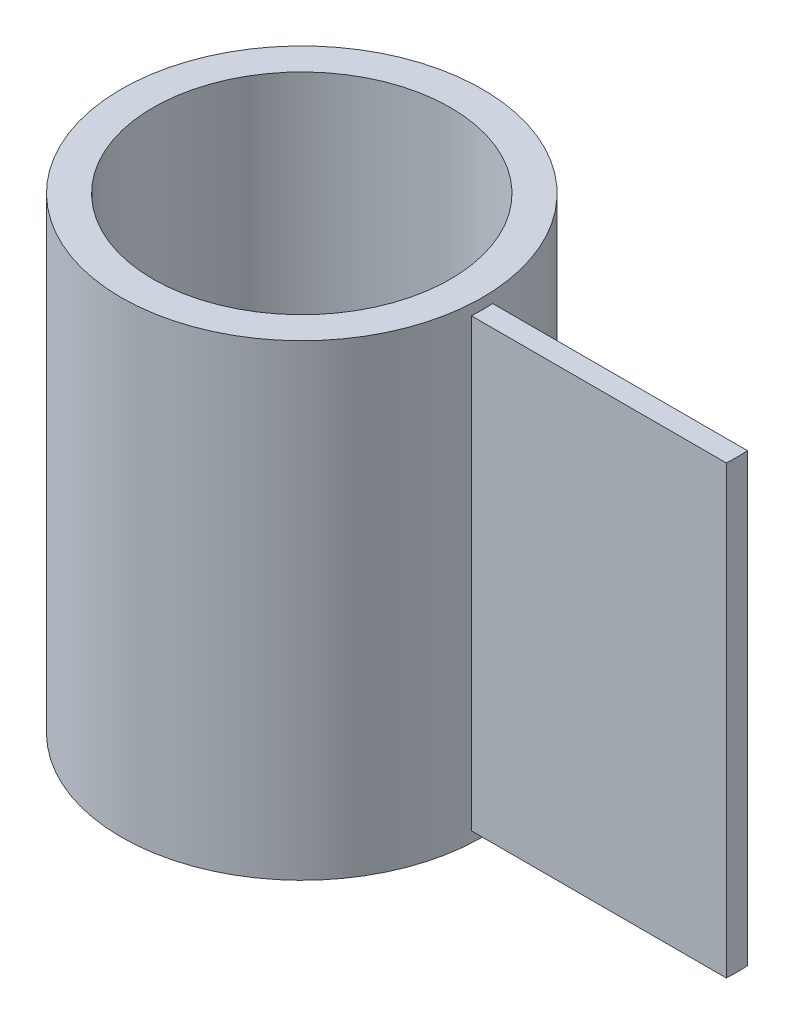
ISO-10303-21;
HEADER;
FILE_DESCRIPTION(('STEP AP214'),'2;1');
FILE_NAME('part.step','',(''),(''),'','','');
FILE_SCHEMA(('AUTOMOTIVE_DESIGN { 1 0 10303 214 1 1 1 1 }'));
ENDSEC;
DATA;
#1=APPLICATION_CONTEXT('core data for automotive mechanical design processes');
#2=APPLICATION_PROTOCOL_DEFINITION('international standard','automotive_design',2000,#1);
#3=PRODUCT_CONTEXT('',#1,'mechanical');
#4=PRODUCT('Part','Part','',(#3));
#5=PRODUCT_RELATED_PRODUCT_CATEGORY('part','',(#4));
#6=PRODUCT_DEFINITION_FORMATION('','',#4);
#7=PRODUCT_DEFINITION_CONTEXT('part definition',#1,'design');
#8=PRODUCT_DEFINITION('design','',#6,#7);
#9=PRODUCT_DEFINITION_SHAPE('','',#8);
#10=(LENGTH_UNIT() NAMED_UNIT(*) SI_UNIT(.MILLI.,.METRE.));
#11=(NAMED_UNIT(*) PLANE_ANGLE_UNIT() SI_UNIT($,.RADIAN.));
#12=(NAMED_UNIT(*) SI_UNIT($,.STERADIAN.) SOLID_ANGLE_UNIT());
#13=UNCERTAINTY_MEASURE_WITH_UNIT(LENGTH_MEASURE(1.E-05),#10,'distance_accuracy_value','');
#14=(GEOMETRIC_REPRESENTATION_CONTEXT(3) GLOBAL_UNCERTAINTY_ASSIGNED_CONTEXT((#13)) GLOBAL_UNIT_ASSIGNED_CONTEXT((#10,
#11,#12)) REPRESENTATION_CONTEXT('',''));
#15=CARTESIAN_POINT('',(0.,0.,0.));
#16=DIRECTION('',(0.,0.,1.));
#17=DIRECTION('',(1.,0.,0.));
#18=AXIS2_PLACEMENT_3D('',#15,#16,#17);
#19=CARTESIAN_POINT('',(0.,110.,0.));
#20=DIRECTION('',(0.,1.,0.));
#21=DIRECTION('',(0.,0.,1.));
#22=AXIS2_PLACEMENT_3D('',#19,#20,#21);
#23=PLANE('',#22);
#24=CARTESIAN_POINT('',(0.,110.,0.));
#25=DIRECTION('',(0.,1.,0.));
#26=DIRECTION('',(0.,0.,1.));
#27=AXIS2_PLACEMENT_3D('',#24,#25,#26);
#28=CIRCLE('',#27,42.5);
#29=CARTESIAN_POINT('',(0.,110.,42.5));
#30=VERTEX_POINT('',#29);
#31=EDGE_CURVE('E11',#30,#30,#28,.T.);
#32=ORIENTED_EDGE('',*,*,#31,.T.);
#33=EDGE_LOOP('',(#32));
#34=FACE_BOUND('',#33,.T.);
#35=CARTESIAN_POINT('',(0.,110.,0.));
#36=DIRECTION('',(0.,1.,0.));
#37=DIRECTION('',(0.,0.,1.));
#38=AXIS2_PLACEMENT_3D('',#35,#36,#37);
#39=CIRCLE('',#38,35.);
#40=CARTESIAN_POINT('',(0.,110.,35.));
#41=VERTEX_POINT('',#40);
#42=EDGE_CURVE('E98',#41,#41,#39,.T.);
#43=ORIENTED_EDGE('',*,*,#42,.F.);
#44=EDGE_LOOP('',(#43));
#45=FACE_BOUND('',#44,.T.);
#46=ADVANCED_FACE('F35',(#34,#45),#23,.T.);
#47=CARTESIAN_POINT('',(0.,0.,0.));
#48=DIRECTION('',(0.,1.,0.));
#49=DIRECTION('',(0.,0.,1.));
#50=AXIS2_PLACEMENT_3D('',#47,#48,#49);
#51=PLANE('',#50);
#52=CARTESIAN_POINT('',(0.,0.,0.));
#53=DIRECTION('',(0.,1.,0.));
#54=DIRECTION('',(0.,0.,1.));
#55=AXIS2_PLACEMENT_3D('',#52,#53,#54);
#56=CIRCLE('',#55,42.5);
#57=CARTESIAN_POINT('',(0.,0.,42.5));
#58=VERTEX_POINT('',#57);
#59=EDGE_CURVE('E39',#58,#58,#56,.T.);
#60=ORIENTED_EDGE('',*,*,#59,.F.);
#61=EDGE_LOOP('',(#60));
#62=FACE_BOUND('',#61,.T.);
#63=CARTESIAN_POINT('',(0.,0.,0.));
#64=DIRECTION('',(0.,1.,0.));
#65=DIRECTION('',(0.,0.,1.));
#66=AXIS2_PLACEMENT_3D('',#63,#64,#65);
#67=CIRCLE('',#66,35.);
#68=CARTESIAN_POINT('',(0.,0.,35.));
#69=VERTEX_POINT('',#68);
#70=EDGE_CURVE('E94',#69,#69,#67,.T.);
#71=ORIENTED_EDGE('',*,*,#70,.T.);
#72=EDGE_LOOP('',(#71));
#73=FACE_BOUND('',#72,.T.);
#74=ADVANCED_FACE('F121',(#62,#73),#51,.F.);
#75=CARTESIAN_POINT('',(0.,110.,0.));
#76=DIRECTION('',(0.,-1.,0.));
#77=DIRECTION('',(0.,0.,-1.));
#78=AXIS2_PLACEMENT_3D('',#75,#76,#77);
#79=CYLINDRICAL_SURFACE('',#78,42.5);
#80=DIRECTION('',(0.,-1.,0.));
#81=VECTOR('',#80,1.);
#82=CARTESIAN_POINT('',(42.4264068711929,110.,2.5));
#83=LINE('',#82,#81);
#84=CARTESIAN_POINT('',(42.4264068711929,107.5,2.5));
#85=VERTEX_POINT('',#84);
#86=CARTESIAN_POINT('',(42.4264068711929,2.5,2.5));
#87=VERTEX_POINT('',#86);
#88=EDGE_CURVE('E50',#85,#87,#83,.T.);
#89=ORIENTED_EDGE('',*,*,#88,.F.);
#90=CARTESIAN_POINT('',(0.,107.5,0.));
#91=DIRECTION('',(0.,-1.,0.));
#92=DIRECTION('',(0.,0.,-1.));
#93=AXIS2_PLACEMENT_3D('',#90,#91,#92);
#94=CIRCLE('',#93,42.5);
#95=CARTESIAN_POINT('',(42.4264068711929,107.5,-2.5));
#96=VERTEX_POINT('',#95);
#97=EDGE_CURVE('E73',#96,#85,#94,.T.);
#98=ORIENTED_EDGE('',*,*,#97,.F.);
#99=DIRECTION('',(0.,-1.,0.));
#100=VECTOR('',#99,1.);
#101=CARTESIAN_POINT('',(42.4264068711929,110.,-2.5));
#102=LINE('',#101,#100);
#103=CARTESIAN_POINT('',(42.4264068711929,2.5,-2.5));
#104=VERTEX_POINT('',#103);
#105=EDGE_CURVE('E77',#96,#104,#102,.T.);
#106=ORIENTED_EDGE('',*,*,#105,.T.);
#107=CARTESIAN_POINT('',(0.,2.5,0.));
#108=DIRECTION('',(0.,1.,0.));
#109=DIRECTION('',(0.,0.,1.));
#110=AXIS2_PLACEMENT_3D('',#107,#108,#109);
#111=CIRCLE('',#110,42.5);
#112=EDGE_CURVE('E55',#87,#104,#111,.T.);
#113=ORIENTED_EDGE('',*,*,#112,.F.);
#114=EDGE_LOOP('',(#89,#98,#106,#113));
#115=FACE_BOUND('',#114,.T.);
#116=ORIENTED_EDGE('',*,*,#31,.F.);
#117=EDGE_LOOP('',(#116));
#118=FACE_BOUND('',#117,.T.);
#119=ORIENTED_EDGE('',*,*,#59,.T.);
#120=EDGE_LOOP('',(#119));
#121=FACE_BOUND('',#120,.T.);
#122=ADVANCED_FACE('F37',(#115,#118,#121),#79,.T.);
#123=CARTESIAN_POINT('',(0.,110.,0.));
#124=DIRECTION('',(0.,-1.,0.));
#125=DIRECTION('',(0.,0.,-1.));
#126=AXIS2_PLACEMENT_3D('',#123,#124,#125);
#127=CYLINDRICAL_SURFACE('',#126,35.);
#128=ORIENTED_EDGE('',*,*,#42,.T.);
#129=EDGE_LOOP('',(#128));
#130=FACE_BOUND('',#129,.T.);
#131=ORIENTED_EDGE('',*,*,#70,.F.);
#132=EDGE_LOOP('',(#131));
#133=FACE_BOUND('',#132,.T.);
#134=ADVANCED_FACE('F126',(#130,#133),#127,.F.);
#135=CARTESIAN_POINT('',(60.,110.,0.));
#136=DIRECTION('',(0.,-1.,0.));
#137=DIRECTION('',(0.,0.,-1.));
#138=AXIS2_PLACEMENT_3D('',#135,#136,#137);
#139=CYLINDRICAL_SURFACE('',#138,42.5);
#140=DIRECTION('',(0.,-1.,0.));
#141=VECTOR('',#140,1.);
#142=CARTESIAN_POINT('',(102.426406871193,110.,-2.5));
#143=LINE('',#142,#141);
#144=CARTESIAN_POINT('',(102.426406871193,107.5,-2.5));
#145=VERTEX_POINT('',#144);
#146=CARTESIAN_POINT('',(102.426406871193,2.5,-2.5));
#147=VERTEX_POINT('',#146);
#148=EDGE_CURVE('E95',#145,#147,#143,.T.);
#149=ORIENTED_EDGE('',*,*,#148,.F.);
#150=CARTESIAN_POINT('',(60.,107.5,0.));
#151=DIRECTION('',(0.,-1.,0.));
#152=DIRECTION('',(0.,0.,-1.));
#153=AXIS2_PLACEMENT_3D('',#150,#151,#152);
#154=CIRCLE('',#153,42.5);
#155=CARTESIAN_POINT('',(102.426406871193,107.5,2.5));
#156=VERTEX_POINT('',#155);
#157=EDGE_CURVE('E87',#145,#156,#154,.T.);
#158=ORIENTED_EDGE('',*,*,#157,.T.);
#159=DIRECTION('',(0.,-1.,0.));
#160=VECTOR('',#159,1.);
#161=CARTESIAN_POINT('',(102.426406871193,110.,2.5));
#162=LINE('',#161,#160);
#163=CARTESIAN_POINT('',(102.426406871193,2.5,2.5));
#164=VERTEX_POINT('',#163);
#165=EDGE_CURVE('E105',#156,#164,#162,.T.);
#166=ORIENTED_EDGE('',*,*,#165,.T.);
#167=CARTESIAN_POINT('',(60.,2.5,0.));
#168=DIRECTION('',(0.,1.,0.));
#169=DIRECTION('',(0.,0.,1.));
#170=AXIS2_PLACEMENT_3D('',#167,#168,#169);
#171=CIRCLE('',#170,42.5);
#172=EDGE_CURVE('E103',#164,#147,#171,.T.);
#173=ORIENTED_EDGE('',*,*,#172,.T.);
#174=EDGE_LOOP('',(#149,#158,#166,#173));
#175=FACE_BOUND('',#174,.T.);
#176=ADVANCED_FACE('F128',(#175),#139,.T.);
#177=CARTESIAN_POINT('',(42.4264068711929,107.5,2.5));
#178=DIRECTION('',(0.,1.,0.));
#179=DIRECTION('',(0.,0.,1.));
#180=AXIS2_PLACEMENT_3D('',#177,#178,#179);
#181=PLANE('',#180);
#182=ORIENTED_EDGE('',*,*,#157,.F.);
#183=DIRECTION('',(1.,0.,0.));
#184=VECTOR('',#183,1.);
#185=CARTESIAN_POINT('',(42.4264068711929,107.5,-2.5));
#186=LINE('',#185,#184);
#187=EDGE_CURVE('E82',#96,#145,#186,.T.);
#188=ORIENTED_EDGE('',*,*,#187,.F.);
#189=ORIENTED_EDGE('',*,*,#97,.T.);
#190=DIRECTION('',(1.,0.,0.));
#191=VECTOR('',#190,1.);
#192=CARTESIAN_POINT('',(42.4264068711929,107.5,2.5));
#193=LINE('',#192,#191);
#194=EDGE_CURVE('E81',#85,#156,#193,.T.);
#195=ORIENTED_EDGE('',*,*,#194,.T.);
#196=EDGE_LOOP('',(#182,#188,#189,#195));
#197=FACE_BOUND('',#196,.T.);
#198=ADVANCED_FACE('F86',(#197),#181,.T.);
#199=CARTESIAN_POINT('',(42.4264068711929,110.,2.5));
#200=DIRECTION('',(0.,0.,1.));
#201=DIRECTION('',(1.,0.,0.));
#202=AXIS2_PLACEMENT_3D('',#199,#200,#201);
#203=PLANE('',#202);
#204=ORIENTED_EDGE('',*,*,#165,.F.);
#205=ORIENTED_EDGE('',*,*,#194,.F.);
#206=ORIENTED_EDGE('',*,*,#88,.T.);
#207=DIRECTION('',(1.,0.,0.));
#208=VECTOR('',#207,1.);
#209=CARTESIAN_POINT('',(42.4264068711929,2.5,2.5));
#210=LINE('',#209,#208);
#211=EDGE_CURVE('E104',#87,#164,#210,.T.);
#212=ORIENTED_EDGE('',*,*,#211,.T.);
#213=EDGE_LOOP('',(#204,#205,#206,#212));
#214=FACE_BOUND('',#213,.T.);
#215=ADVANCED_FACE('F171',(#214),#203,.T.);
#216=CARTESIAN_POINT('',(42.4264068711929,2.5,-2.5));
#217=DIRECTION('',(0.,-1.,0.));
#218=DIRECTION('',(0.,0.,-1.));
#219=AXIS2_PLACEMENT_3D('',#216,#217,#218);
#220=PLANE('',#219);
#221=ORIENTED_EDGE('',*,*,#172,.F.);
#222=ORIENTED_EDGE('',*,*,#211,.F.);
#223=ORIENTED_EDGE('',*,*,#112,.T.);
#224=DIRECTION('',(1.,0.,0.));
#225=VECTOR('',#224,1.);
#226=CARTESIAN_POINT('',(42.4264068711929,2.5,-2.5));
#227=LINE('',#226,#225);
#228=EDGE_CURVE('E93',#104,#147,#227,.T.);
#229=ORIENTED_EDGE('',*,*,#228,.T.);
#230=EDGE_LOOP('',(#221,#222,#223,#229));
#231=FACE_BOUND('',#230,.T.);
#232=ADVANCED_FACE('F138',(#231),#220,.T.);
#233=CARTESIAN_POINT('',(42.4264068711929,110.,-2.5));
#234=DIRECTION('',(0.,0.,1.));
#235=DIRECTION('',(1.,0.,0.));
#236=AXIS2_PLACEMENT_3D('',#233,#234,#235);
#237=PLANE('',#236);
#238=ORIENTED_EDGE('',*,*,#148,.T.);
#239=ORIENTED_EDGE('',*,*,#228,.F.);
#240=ORIENTED_EDGE('',*,*,#105,.F.);
#241=ORIENTED_EDGE('',*,*,#187,.T.);
#242=EDGE_LOOP('',(#238,#239,#240,#241));
#243=FACE_BOUND('',#242,.T.);
#244=ADVANCED_FACE('F91',(#243),#237,.F.);
#245=CLOSED_SHELL('',(#46,#74,#122,#134,#176,#198,#215,#232,#244));
#246=MANIFOLD_SOLID_BREP('B2',#245);
#247=ADVANCED_BREP_SHAPE_REPRESENTATION('',(#18,#246),#14);
#248=SHAPE_DEFINITION_REPRESENTATION(#9,#247);
ENDSEC;
END-ISO-10303-21;
